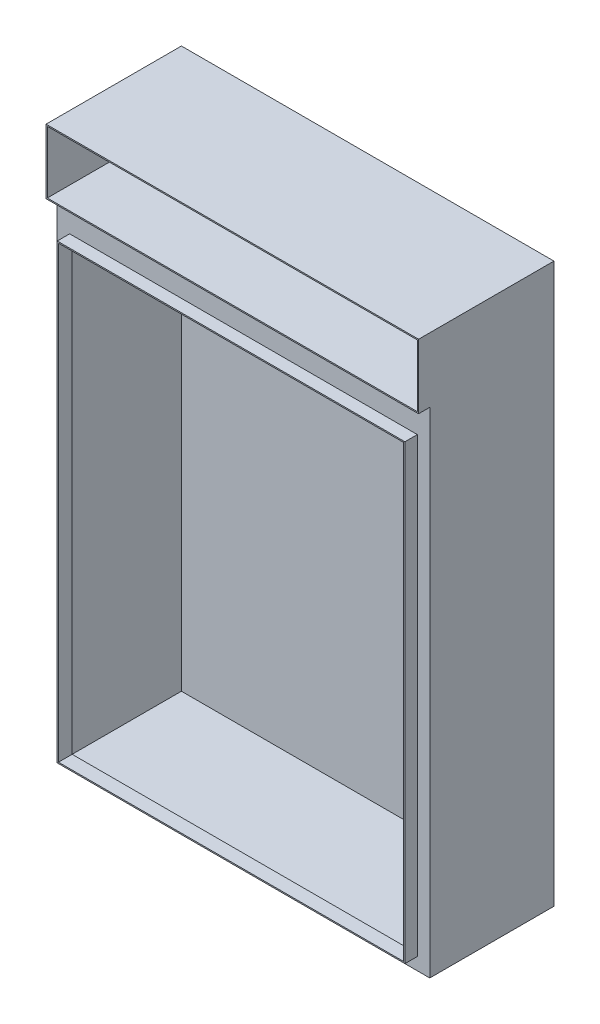
ISO-10303-21;
HEADER;
FILE_DESCRIPTION(('STEP AP214'),'2;1');
FILE_NAME('part.step','',(''),(''),'','','');
FILE_SCHEMA(('AUTOMOTIVE_DESIGN { 1 0 10303 214 1 1 1 1 }'));
ENDSEC;
DATA;
#1=APPLICATION_CONTEXT('core data for automotive mechanical design processes');
#2=APPLICATION_PROTOCOL_DEFINITION('international standard','automotive_design',2000,#1);
#3=PRODUCT_CONTEXT('',#1,'mechanical');
#4=PRODUCT('Part','Part','',(#3));
#5=PRODUCT_RELATED_PRODUCT_CATEGORY('part','',(#4));
#6=PRODUCT_DEFINITION_FORMATION('','',#4);
#7=PRODUCT_DEFINITION_CONTEXT('part definition',#1,'design');
#8=PRODUCT_DEFINITION('design','',#6,#7);
#9=PRODUCT_DEFINITION_SHAPE('','',#8);
#10=(LENGTH_UNIT() NAMED_UNIT(*) SI_UNIT(.MILLI.,.METRE.));
#11=(NAMED_UNIT(*) PLANE_ANGLE_UNIT() SI_UNIT($,.RADIAN.));
#12=(NAMED_UNIT(*) SI_UNIT($,.STERADIAN.) SOLID_ANGLE_UNIT());
#13=UNCERTAINTY_MEASURE_WITH_UNIT(LENGTH_MEASURE(1.E-05),#10,'distance_accuracy_value','');
#14=(GEOMETRIC_REPRESENTATION_CONTEXT(3) GLOBAL_UNCERTAINTY_ASSIGNED_CONTEXT((#13)) GLOBAL_UNIT_ASSIGNED_CONTEXT((#10,
#11,#12)) REPRESENTATION_CONTEXT('',''));
#15=CARTESIAN_POINT('',(0.,0.,0.));
#16=DIRECTION('',(0.,0.,1.));
#17=DIRECTION('',(1.,0.,0.));
#18=AXIS2_PLACEMENT_3D('',#15,#16,#17);
#19=CARTESIAN_POINT('',(0.,0.,200.));
#20=DIRECTION('',(0.,0.,1.));
#21=DIRECTION('',(1.,0.,0.));
#22=AXIS2_PLACEMENT_3D('',#19,#20,#21);
#23=PLANE('',#22);
#24=DIRECTION('',(1.,0.,0.));
#25=VECTOR('',#24,1.);
#26=CARTESIAN_POINT('',(-280.,-430.,200.));
#27=LINE('',#26,#25);
#28=CARTESIAN_POINT('',(-280.,-430.,200.));
#29=VERTEX_POINT('',#28);
#30=CARTESIAN_POINT('',(280.,-430.,200.));
#31=VERTEX_POINT('',#30);
#32=EDGE_CURVE('E282',#29,#31,#27,.T.);
#33=ORIENTED_EDGE('',*,*,#32,.F.);
#34=DIRECTION('',(0.,-1.,0.));
#35=VECTOR('',#34,1.);
#36=CARTESIAN_POINT('',(-280.,298.,200.));
#37=LINE('',#36,#35);
#38=CARTESIAN_POINT('',(-280.,298.,200.));
#39=VERTEX_POINT('',#38);
#40=EDGE_CURVE('E263',#39,#29,#37,.T.);
#41=ORIENTED_EDGE('',*,*,#40,.F.);
#42=DIRECTION('',(-1.,0.,0.));
#43=VECTOR('',#42,1.);
#44=CARTESIAN_POINT('',(-280.,298.,200.));
#45=LINE('',#44,#43);
#46=CARTESIAN_POINT('',(280.,298.,200.));
#47=VERTEX_POINT('',#46);
#48=EDGE_CURVE('E269',#47,#39,#45,.T.);
#49=ORIENTED_EDGE('',*,*,#48,.F.);
#50=DIRECTION('',(0.,1.,0.));
#51=VECTOR('',#50,1.);
#52=CARTESIAN_POINT('',(280.,298.,200.));
#53=LINE('',#52,#51);
#54=EDGE_CURVE('E285',#31,#47,#53,.T.);
#55=ORIENTED_EDGE('',*,*,#54,.F.);
#56=EDGE_LOOP('',(#33,#41,#49,#55));
#57=FACE_BOUND('',#56,.T.);
#58=DIRECTION('',(0.,1.,0.));
#59=VECTOR('',#58,1.);
#60=CARTESIAN_POINT('',(300.,-450.,200.));
#61=LINE('',#60,#59);
#62=CARTESIAN_POINT('',(300.,-450.,200.));
#63=VERTEX_POINT('',#62);
#64=CARTESIAN_POINT('',(300.,346.,200.));
#65=VERTEX_POINT('',#64);
#66=EDGE_CURVE('E55',#63,#65,#61,.T.);
#67=ORIENTED_EDGE('',*,*,#66,.T.);
#68=DIRECTION('',(1.,0.,0.));
#69=VECTOR('',#68,1.);
#70=CARTESIAN_POINT('',(-300.,346.,200.));
#71=LINE('',#70,#69);
#72=CARTESIAN_POINT('',(-300.,346.,200.));
#73=VERTEX_POINT('',#72);
#74=EDGE_CURVE('E59',#73,#65,#71,.T.);
#75=ORIENTED_EDGE('',*,*,#74,.F.);
#76=DIRECTION('',(0.,-1.,0.));
#77=VECTOR('',#76,1.);
#78=CARTESIAN_POINT('',(-300.,-450.,200.));
#79=LINE('',#78,#77);
#80=CARTESIAN_POINT('',(-300.,-450.,200.));
#81=VERTEX_POINT('',#80);
#82=EDGE_CURVE('E388',#73,#81,#79,.T.);
#83=ORIENTED_EDGE('',*,*,#82,.T.);
#84=DIRECTION('',(1.,0.,0.));
#85=VECTOR('',#84,1.);
#86=CARTESIAN_POINT('',(300.,-450.,200.));
#87=LINE('',#86,#85);
#88=EDGE_CURVE('E391',#81,#63,#87,.T.);
#89=ORIENTED_EDGE('',*,*,#88,.T.);
#90=EDGE_LOOP('',(#67,#75,#83,#89));
#91=FACE_BOUND('',#90,.T.);
#92=ADVANCED_FACE('F39',(#57,#91),#23,.T.);
#93=CARTESIAN_POINT('',(0.,0.,198.));
#94=DIRECTION('',(0.,0.,1.));
#95=DIRECTION('',(1.,0.,0.));
#96=AXIS2_PLACEMENT_3D('',#93,#94,#95);
#97=PLANE('',#96);
#98=DIRECTION('',(-1.,0.,0.));
#99=VECTOR('',#98,1.);
#100=CARTESIAN_POINT('',(-278.,296.,198.));
#101=LINE('',#100,#99);
#102=CARTESIAN_POINT('',(278.,296.,198.));
#103=VERTEX_POINT('',#102);
#104=CARTESIAN_POINT('',(-278.,296.,198.));
#105=VERTEX_POINT('',#104);
#106=EDGE_CURVE('E316',#103,#105,#101,.T.);
#107=ORIENTED_EDGE('',*,*,#106,.T.);
#108=DIRECTION('',(0.,-1.,0.));
#109=VECTOR('',#108,1.);
#110=CARTESIAN_POINT('',(-278.,296.,198.));
#111=LINE('',#110,#109);
#112=CARTESIAN_POINT('',(-278.,-428.,198.));
#113=VERTEX_POINT('',#112);
#114=EDGE_CURVE('E304',#105,#113,#111,.T.);
#115=ORIENTED_EDGE('',*,*,#114,.T.);
#116=DIRECTION('',(1.,0.,0.));
#117=VECTOR('',#116,1.);
#118=CARTESIAN_POINT('',(-278.,-428.,198.));
#119=LINE('',#118,#117);
#120=CARTESIAN_POINT('',(278.,-428.,198.));
#121=VERTEX_POINT('',#120);
#122=EDGE_CURVE('E308',#113,#121,#119,.T.);
#123=ORIENTED_EDGE('',*,*,#122,.T.);
#124=DIRECTION('',(0.,1.,0.));
#125=VECTOR('',#124,1.);
#126=CARTESIAN_POINT('',(278.,296.,198.));
#127=LINE('',#126,#125);
#128=EDGE_CURVE('E312',#121,#103,#127,.T.);
#129=ORIENTED_EDGE('',*,*,#128,.T.);
#130=EDGE_LOOP('',(#107,#115,#123,#129));
#131=FACE_BOUND('',#130,.T.);
#132=DIRECTION('',(0.,-1.,0.));
#133=VECTOR('',#132,1.);
#134=CARTESIAN_POINT('',(-298.,346.,198.));
#135=LINE('',#134,#133);
#136=CARTESIAN_POINT('',(-298.,346.,198.));
#137=VERTEX_POINT('',#136);
#138=CARTESIAN_POINT('',(-298.,-448.,198.));
#139=VERTEX_POINT('',#138);
#140=EDGE_CURVE('E324',#137,#139,#135,.T.);
#141=ORIENTED_EDGE('',*,*,#140,.F.);
#142=DIRECTION('',(-1.,0.,0.));
#143=VECTOR('',#142,1.);
#144=CARTESIAN_POINT('',(-298.,346.,198.));
#145=LINE('',#144,#143);
#146=CARTESIAN_POINT('',(298.,346.,198.));
#147=VERTEX_POINT('',#146);
#148=EDGE_CURVE('E342',#147,#137,#145,.T.);
#149=ORIENTED_EDGE('',*,*,#148,.F.);
#150=DIRECTION('',(0.,1.,0.));
#151=VECTOR('',#150,1.);
#152=CARTESIAN_POINT('',(298.,346.,198.));
#153=LINE('',#152,#151);
#154=CARTESIAN_POINT('',(298.,-448.,198.));
#155=VERTEX_POINT('',#154);
#156=EDGE_CURVE('E338',#155,#147,#153,.T.);
#157=ORIENTED_EDGE('',*,*,#156,.F.);
#158=DIRECTION('',(1.,0.,0.));
#159=VECTOR('',#158,1.);
#160=CARTESIAN_POINT('',(-298.,-448.,198.));
#161=LINE('',#160,#159);
#162=EDGE_CURVE('E335',#139,#155,#161,.T.);
#163=ORIENTED_EDGE('',*,*,#162,.F.);
#164=EDGE_LOOP('',(#141,#149,#157,#163));
#165=FACE_BOUND('',#164,.T.);
#166=ADVANCED_FACE('F453',(#131,#165),#97,.F.);
#167=CARTESIAN_POINT('',(-278.,296.,198.));
#168=DIRECTION('',(-1.,0.,0.));
#169=DIRECTION('',(0.,-1.,0.));
#170=AXIS2_PLACEMENT_3D('',#167,#168,#169);
#171=PLANE('',#170);
#172=DIRECTION('',(0.,0.,1.));
#173=VECTOR('',#172,1.);
#174=CARTESIAN_POINT('',(-278.,296.,198.));
#175=LINE('',#174,#173);
#176=CARTESIAN_POINT('',(-278.,296.,220.));
#177=VERTEX_POINT('',#176);
#178=EDGE_CURVE('E321',#105,#177,#175,.T.);
#179=ORIENTED_EDGE('',*,*,#178,.T.);
#180=DIRECTION('',(0.,-1.,0.));
#181=VECTOR('',#180,1.);
#182=CARTESIAN_POINT('',(-278.,296.,220.));
#183=LINE('',#182,#181);
#184=CARTESIAN_POINT('',(-278.,-428.,220.));
#185=VERTEX_POINT('',#184);
#186=EDGE_CURVE('E247',#177,#185,#183,.T.);
#187=ORIENTED_EDGE('',*,*,#186,.T.);
#188=DIRECTION('',(0.,0.,1.));
#189=VECTOR('',#188,1.);
#190=CARTESIAN_POINT('',(-278.,-428.,198.));
#191=LINE('',#190,#189);
#192=EDGE_CURVE('E320',#113,#185,#191,.T.);
#193=ORIENTED_EDGE('',*,*,#192,.F.);
#194=ORIENTED_EDGE('',*,*,#114,.F.);
#195=EDGE_LOOP('',(#179,#187,#193,#194));
#196=FACE_BOUND('',#195,.T.);
#197=ADVANCED_FACE('F459',(#196),#171,.F.);
#198=CARTESIAN_POINT('',(-278.,296.,198.));
#199=DIRECTION('',(0.,1.,0.));
#200=DIRECTION('',(0.,0.,1.));
#201=AXIS2_PLACEMENT_3D('',#198,#199,#200);
#202=PLANE('',#201);
#203=DIRECTION('',(0.,0.,1.));
#204=VECTOR('',#203,1.);
#205=CARTESIAN_POINT('',(278.,296.,198.));
#206=LINE('',#205,#204);
#207=CARTESIAN_POINT('',(278.,296.,220.));
#208=VERTEX_POINT('',#207);
#209=EDGE_CURVE('E325',#103,#208,#206,.T.);
#210=ORIENTED_EDGE('',*,*,#209,.T.);
#211=DIRECTION('',(-1.,0.,0.));
#212=VECTOR('',#211,1.);
#213=CARTESIAN_POINT('',(-278.,296.,220.));
#214=LINE('',#213,#212);
#215=EDGE_CURVE('E259',#208,#177,#214,.T.);
#216=ORIENTED_EDGE('',*,*,#215,.T.);
#217=ORIENTED_EDGE('',*,*,#178,.F.);
#218=ORIENTED_EDGE('',*,*,#106,.F.);
#219=EDGE_LOOP('',(#210,#216,#217,#218));
#220=FACE_BOUND('',#219,.T.);
#221=ADVANCED_FACE('F584',(#220),#202,.F.);
#222=CARTESIAN_POINT('',(278.,296.,198.));
#223=DIRECTION('',(1.,0.,0.));
#224=DIRECTION('',(0.,1.,0.));
#225=AXIS2_PLACEMENT_3D('',#222,#223,#224);
#226=PLANE('',#225);
#227=DIRECTION('',(0.,0.,1.));
#228=VECTOR('',#227,1.);
#229=CARTESIAN_POINT('',(278.,-428.,198.));
#230=LINE('',#229,#228);
#231=CARTESIAN_POINT('',(278.,-428.,220.));
#232=VERTEX_POINT('',#231);
#233=EDGE_CURVE('E328',#121,#232,#230,.T.);
#234=ORIENTED_EDGE('',*,*,#233,.T.);
#235=DIRECTION('',(0.,1.,0.));
#236=VECTOR('',#235,1.);
#237=CARTESIAN_POINT('',(278.,296.,220.));
#238=LINE('',#237,#236);
#239=EDGE_CURVE('E255',#232,#208,#238,.T.);
#240=ORIENTED_EDGE('',*,*,#239,.T.);
#241=ORIENTED_EDGE('',*,*,#209,.F.);
#242=ORIENTED_EDGE('',*,*,#128,.F.);
#243=EDGE_LOOP('',(#234,#240,#241,#242));
#244=FACE_BOUND('',#243,.T.);
#245=ADVANCED_FACE('F595',(#244),#226,.F.);
#246=CARTESIAN_POINT('',(-278.,-428.,198.));
#247=DIRECTION('',(0.,-1.,0.));
#248=DIRECTION('',(0.,0.,-1.));
#249=AXIS2_PLACEMENT_3D('',#246,#247,#248);
#250=PLANE('',#249);
#251=ORIENTED_EDGE('',*,*,#192,.T.);
#252=DIRECTION('',(1.,0.,0.));
#253=VECTOR('',#252,1.);
#254=CARTESIAN_POINT('',(-278.,-428.,220.));
#255=LINE('',#254,#253);
#256=EDGE_CURVE('E251',#185,#232,#255,.T.);
#257=ORIENTED_EDGE('',*,*,#256,.T.);
#258=ORIENTED_EDGE('',*,*,#233,.F.);
#259=ORIENTED_EDGE('',*,*,#122,.F.);
#260=EDGE_LOOP('',(#251,#257,#258,#259));
#261=FACE_BOUND('',#260,.T.);
#262=ADVANCED_FACE('F605',(#261),#250,.F.);
#263=CARTESIAN_POINT('',(0.,0.,2.));
#264=DIRECTION('',(0.,0.,1.));
#265=DIRECTION('',(1.,0.,0.));
#266=AXIS2_PLACEMENT_3D('',#263,#264,#265);
#267=PLANE('',#266);
#268=DIRECTION('',(0.,1.,0.));
#269=VECTOR('',#268,1.);
#270=CARTESIAN_POINT('',(298.,-450.,2.));
#271=LINE('',#270,#269);
#272=CARTESIAN_POINT('',(298.,-448.,2.));
#273=VERTEX_POINT('',#272);
#274=CARTESIAN_POINT('',(298.,346.,2.));
#275=VERTEX_POINT('',#274);
#276=EDGE_CURVE('E379',#273,#275,#271,.T.);
#277=ORIENTED_EDGE('',*,*,#276,.T.);
#278=DIRECTION('',(1.,0.,0.));
#279=VECTOR('',#278,1.);
#280=CARTESIAN_POINT('',(298.,346.,2.));
#281=LINE('',#280,#279);
#282=CARTESIAN_POINT('',(-298.,346.,2.));
#283=VERTEX_POINT('',#282);
#284=EDGE_CURVE('E345',#283,#275,#281,.T.);
#285=ORIENTED_EDGE('',*,*,#284,.F.);
#286=DIRECTION('',(0.,-1.,0.));
#287=VECTOR('',#286,1.);
#288=CARTESIAN_POINT('',(-298.,-450.,2.));
#289=LINE('',#288,#287);
#290=CARTESIAN_POINT('',(-298.,-448.,2.));
#291=VERTEX_POINT('',#290);
#292=EDGE_CURVE('E359',#283,#291,#289,.T.);
#293=ORIENTED_EDGE('',*,*,#292,.T.);
#294=DIRECTION('',(1.,0.,0.));
#295=VECTOR('',#294,1.);
#296=CARTESIAN_POINT('',(300.,-448.,2.));
#297=LINE('',#296,#295);
#298=EDGE_CURVE('E363',#291,#273,#297,.T.);
#299=ORIENTED_EDGE('',*,*,#298,.T.);
#300=EDGE_LOOP('',(#277,#285,#293,#299));
#301=FACE_BOUND('',#300,.T.);
#302=ADVANCED_FACE('F449',(#301),#267,.T.);
#303=CARTESIAN_POINT('',(298.,346.,200.));
#304=DIRECTION('',(0.,1.,0.));
#305=DIRECTION('',(0.,0.,1.));
#306=AXIS2_PLACEMENT_3D('',#303,#304,#305);
#307=PLANE('',#306);
#308=ORIENTED_EDGE('',*,*,#148,.T.);
#309=DIRECTION('',(0.,0.,-1.));
#310=VECTOR('',#309,1.);
#311=CARTESIAN_POINT('',(-298.,346.,200.));
#312=LINE('',#311,#310);
#313=EDGE_CURVE('E356',#137,#283,#312,.T.);
#314=ORIENTED_EDGE('',*,*,#313,.T.);
#315=ORIENTED_EDGE('',*,*,#284,.T.);
#316=DIRECTION('',(0.,0.,-1.));
#317=VECTOR('',#316,1.);
#318=CARTESIAN_POINT('',(298.,346.,200.));
#319=LINE('',#318,#317);
#320=EDGE_CURVE('E353',#147,#275,#319,.T.);
#321=ORIENTED_EDGE('',*,*,#320,.F.);
#322=EDGE_LOOP('',(#308,#314,#315,#321));
#323=FACE_BOUND('',#322,.T.);
#324=ADVANCED_FACE('F539',(#323),#307,.F.);
#325=CARTESIAN_POINT('',(300.,-448.,200.));
#326=DIRECTION('',(0.,1.,0.));
#327=DIRECTION('',(-1.,0.,0.));
#328=AXIS2_PLACEMENT_3D('',#325,#326,#327);
#329=PLANE('',#328);
#330=DIRECTION('',(0.,0.,-1.));
#331=VECTOR('',#330,1.);
#332=CARTESIAN_POINT('',(-298.,-448.,200.));
#333=LINE('',#332,#331);
#334=EDGE_CURVE('E364',#139,#291,#333,.T.);
#335=ORIENTED_EDGE('',*,*,#334,.F.);
#336=ORIENTED_EDGE('',*,*,#162,.T.);
#337=DIRECTION('',(0.,0.,-1.));
#338=VECTOR('',#337,1.);
#339=CARTESIAN_POINT('',(298.,-448.,200.));
#340=LINE('',#339,#338);
#341=EDGE_CURVE('E368',#155,#273,#340,.T.);
#342=ORIENTED_EDGE('',*,*,#341,.T.);
#343=ORIENTED_EDGE('',*,*,#298,.F.);
#344=EDGE_LOOP('',(#335,#336,#342,#343));
#345=FACE_BOUND('',#344,.T.);
#346=ADVANCED_FACE('F545',(#345),#329,.T.);
#347=CARTESIAN_POINT('',(298.,-450.,200.));
#348=DIRECTION('',(-1.,0.,0.));
#349=DIRECTION('',(0.,0.,1.));
#350=AXIS2_PLACEMENT_3D('',#347,#348,#349);
#351=PLANE('',#350);
#352=ORIENTED_EDGE('',*,*,#341,.F.);
#353=ORIENTED_EDGE('',*,*,#156,.T.);
#354=ORIENTED_EDGE('',*,*,#320,.T.);
#355=ORIENTED_EDGE('',*,*,#276,.F.);
#356=EDGE_LOOP('',(#352,#353,#354,#355));
#357=FACE_BOUND('',#356,.T.);
#358=ADVANCED_FACE('F508',(#357),#351,.T.);
#359=CARTESIAN_POINT('',(-298.,-450.,200.));
#360=DIRECTION('',(1.,0.,0.));
#361=DIRECTION('',(0.,0.,-1.));
#362=AXIS2_PLACEMENT_3D('',#359,#360,#361);
#363=PLANE('',#362);
#364=ORIENTED_EDGE('',*,*,#313,.F.);
#365=ORIENTED_EDGE('',*,*,#140,.T.);
#366=ORIENTED_EDGE('',*,*,#334,.T.);
#367=ORIENTED_EDGE('',*,*,#292,.F.);
#368=EDGE_LOOP('',(#364,#365,#366,#367));
#369=FACE_BOUND('',#368,.T.);
#370=ADVANCED_FACE('F526',(#369),#363,.T.);
#371=CARTESIAN_POINT('',(0.,0.,220.));
#372=DIRECTION('',(0.,0.,1.));
#373=DIRECTION('',(1.,0.,0.));
#374=AXIS2_PLACEMENT_3D('',#371,#372,#373);
#375=PLANE('',#374);
#376=DIRECTION('',(0.,-1.,0.));
#377=VECTOR('',#376,1.);
#378=CARTESIAN_POINT('',(-280.,298.,220.));
#379=LINE('',#378,#377);
#380=CARTESIAN_POINT('',(-280.,298.,220.));
#381=VERTEX_POINT('',#380);
#382=CARTESIAN_POINT('',(-280.,-430.,220.));
#383=VERTEX_POINT('',#382);
#384=EDGE_CURVE('E264',#381,#383,#379,.T.);
#385=ORIENTED_EDGE('',*,*,#384,.T.);
#386=DIRECTION('',(1.,0.,0.));
#387=VECTOR('',#386,1.);
#388=CARTESIAN_POINT('',(-280.,-430.,220.));
#389=LINE('',#388,#387);
#390=CARTESIAN_POINT('',(280.,-430.,220.));
#391=VERTEX_POINT('',#390);
#392=EDGE_CURVE('E268',#383,#391,#389,.T.);
#393=ORIENTED_EDGE('',*,*,#392,.T.);
#394=DIRECTION('',(0.,1.,0.));
#395=VECTOR('',#394,1.);
#396=CARTESIAN_POINT('',(280.,298.,220.));
#397=LINE('',#396,#395);
#398=CARTESIAN_POINT('',(280.,298.,220.));
#399=VERTEX_POINT('',#398);
#400=EDGE_CURVE('E272',#391,#399,#397,.T.);
#401=ORIENTED_EDGE('',*,*,#400,.T.);
#402=DIRECTION('',(-1.,0.,0.));
#403=VECTOR('',#402,1.);
#404=CARTESIAN_POINT('',(-280.,298.,220.));
#405=LINE('',#404,#403);
#406=EDGE_CURVE('E275',#399,#381,#405,.T.);
#407=ORIENTED_EDGE('',*,*,#406,.T.);
#408=EDGE_LOOP('',(#385,#393,#401,#407));
#409=FACE_BOUND('',#408,.T.);
#410=ORIENTED_EDGE('',*,*,#256,.F.);
#411=ORIENTED_EDGE('',*,*,#186,.F.);
#412=ORIENTED_EDGE('',*,*,#215,.F.);
#413=ORIENTED_EDGE('',*,*,#239,.F.);
#414=EDGE_LOOP('',(#410,#411,#412,#413));
#415=FACE_BOUND('',#414,.T.);
#416=ADVANCED_FACE('F570',(#409,#415),#375,.T.);
#417=CARTESIAN_POINT('',(-280.,298.,220.));
#418=DIRECTION('',(1.,0.,0.));
#419=DIRECTION('',(0.,1.,0.));
#420=AXIS2_PLACEMENT_3D('',#417,#418,#419);
#421=PLANE('',#420);
#422=ORIENTED_EDGE('',*,*,#40,.T.);
#423=DIRECTION('',(0.,0.,-1.));
#424=VECTOR('',#423,1.);
#425=CARTESIAN_POINT('',(-280.,-430.,220.));
#426=LINE('',#425,#424);
#427=EDGE_CURVE('E301',#383,#29,#426,.T.);
#428=ORIENTED_EDGE('',*,*,#427,.F.);
#429=ORIENTED_EDGE('',*,*,#384,.F.);
#430=DIRECTION('',(0.,0.,-1.));
#431=VECTOR('',#430,1.);
#432=CARTESIAN_POINT('',(-280.,298.,220.));
#433=LINE('',#432,#431);
#434=EDGE_CURVE('E278',#381,#39,#433,.T.);
#435=ORIENTED_EDGE('',*,*,#434,.T.);
#436=EDGE_LOOP('',(#422,#428,#429,#435));
#437=FACE_BOUND('',#436,.T.);
#438=ADVANCED_FACE('F627',(#437),#421,.F.);
#439=CARTESIAN_POINT('',(-280.,-430.,220.));
#440=DIRECTION('',(0.,1.,0.));
#441=DIRECTION('',(0.,0.,1.));
#442=AXIS2_PLACEMENT_3D('',#439,#440,#441);
#443=PLANE('',#442);
#444=ORIENTED_EDGE('',*,*,#32,.T.);
#445=DIRECTION('',(0.,0.,-1.));
#446=VECTOR('',#445,1.);
#447=CARTESIAN_POINT('',(280.,-430.,220.));
#448=LINE('',#447,#446);
#449=EDGE_CURVE('E297',#391,#31,#448,.T.);
#450=ORIENTED_EDGE('',*,*,#449,.F.);
#451=ORIENTED_EDGE('',*,*,#392,.F.);
#452=ORIENTED_EDGE('',*,*,#427,.T.);
#453=EDGE_LOOP('',(#444,#450,#451,#452));
#454=FACE_BOUND('',#453,.T.);
#455=ADVANCED_FACE('F635',(#454),#443,.F.);
#456=CARTESIAN_POINT('',(280.,298.,220.));
#457=DIRECTION('',(-1.,0.,0.));
#458=DIRECTION('',(0.,-1.,0.));
#459=AXIS2_PLACEMENT_3D('',#456,#457,#458);
#460=PLANE('',#459);
#461=ORIENTED_EDGE('',*,*,#54,.T.);
#462=DIRECTION('',(0.,0.,-1.));
#463=VECTOR('',#462,1.);
#464=CARTESIAN_POINT('',(280.,298.,220.));
#465=LINE('',#464,#463);
#466=EDGE_CURVE('E294',#399,#47,#465,.T.);
#467=ORIENTED_EDGE('',*,*,#466,.F.);
#468=ORIENTED_EDGE('',*,*,#400,.F.);
#469=ORIENTED_EDGE('',*,*,#449,.T.);
#470=EDGE_LOOP('',(#461,#467,#468,#469));
#471=FACE_BOUND('',#470,.T.);
#472=ADVANCED_FACE('F644',(#471),#460,.F.);
#473=CARTESIAN_POINT('',(-280.,298.,220.));
#474=DIRECTION('',(0.,-1.,0.));
#475=DIRECTION('',(0.,0.,-1.));
#476=AXIS2_PLACEMENT_3D('',#473,#474,#475);
#477=PLANE('',#476);
#478=ORIENTED_EDGE('',*,*,#48,.T.);
#479=ORIENTED_EDGE('',*,*,#434,.F.);
#480=ORIENTED_EDGE('',*,*,#406,.F.);
#481=ORIENTED_EDGE('',*,*,#466,.T.);
#482=EDGE_LOOP('',(#478,#479,#480,#481));
#483=FACE_BOUND('',#482,.T.);
#484=ADVANCED_FACE('F467',(#483),#477,.F.);
#485=CARTESIAN_POINT('',(0.,0.,0.));
#486=DIRECTION('',(0.,0.,1.));
#487=DIRECTION('',(1.,0.,0.));
#488=AXIS2_PLACEMENT_3D('',#485,#486,#487);
#489=PLANE('',#488);
#490=DIRECTION('',(0.,-1.,0.));
#491=VECTOR('',#490,1.);
#492=CARTESIAN_POINT('',(-300.,-450.,0.));
#493=LINE('',#492,#491);
#494=CARTESIAN_POINT('',(-300.,450.,0.));
#495=VERTEX_POINT('',#494);
#496=CARTESIAN_POINT('',(-300.,-450.,0.));
#497=VERTEX_POINT('',#496);
#498=EDGE_CURVE('E367',#495,#497,#493,.T.);
#499=ORIENTED_EDGE('',*,*,#498,.F.);
#500=DIRECTION('',(-1.,0.,0.));
#501=VECTOR('',#500,1.);
#502=CARTESIAN_POINT('',(300.,450.,0.));
#503=LINE('',#502,#501);
#504=CARTESIAN_POINT('',(300.,450.,0.));
#505=VERTEX_POINT('',#504);
#506=EDGE_CURVE('E392',#505,#495,#503,.T.);
#507=ORIENTED_EDGE('',*,*,#506,.F.);
#508=DIRECTION('',(0.,1.,0.));
#509=VECTOR('',#508,1.);
#510=CARTESIAN_POINT('',(300.,-450.,0.));
#511=LINE('',#510,#509);
#512=CARTESIAN_POINT('',(300.,-450.,0.));
#513=VERTEX_POINT('',#512);
#514=EDGE_CURVE('E404',#513,#505,#511,.T.);
#515=ORIENTED_EDGE('',*,*,#514,.F.);
#516=DIRECTION('',(1.,0.,0.));
#517=VECTOR('',#516,1.);
#518=CARTESIAN_POINT('',(300.,-450.,0.));
#519=LINE('',#518,#517);
#520=EDGE_CURVE('E401',#497,#513,#519,.T.);
#521=ORIENTED_EDGE('',*,*,#520,.F.);
#522=EDGE_LOOP('',(#499,#507,#515,#521));
#523=FACE_BOUND('',#522,.T.);
#524=ADVANCED_FACE('F426',(#523),#489,.F.);
#525=CARTESIAN_POINT('',(300.,450.,200.));
#526=DIRECTION('',(0.,-1.,0.));
#527=DIRECTION('',(1.,0.,0.));
#528=AXIS2_PLACEMENT_3D('',#525,#526,#527);
#529=PLANE('',#528);
#530=ORIENTED_EDGE('',*,*,#506,.T.);
#531=DIRECTION('',(0.,0.,-1.));
#532=VECTOR('',#531,1.);
#533=CARTESIAN_POINT('',(-300.,450.,200.));
#534=LINE('',#533,#532);
#535=CARTESIAN_POINT('',(-300.,450.,218.));
#536=VERTEX_POINT('',#535);
#537=EDGE_CURVE('E397',#536,#495,#534,.T.);
#538=ORIENTED_EDGE('',*,*,#537,.F.);
#539=DIRECTION('',(-1.,0.,0.));
#540=VECTOR('',#539,1.);
#541=CARTESIAN_POINT('',(-300.,450.,218.));
#542=LINE('',#541,#540);
#543=CARTESIAN_POINT('',(300.,450.,218.));
#544=VERTEX_POINT('',#543);
#545=EDGE_CURVE('E233',#544,#536,#542,.T.);
#546=ORIENTED_EDGE('',*,*,#545,.F.);
#547=DIRECTION('',(0.,0.,-1.));
#548=VECTOR('',#547,1.);
#549=CARTESIAN_POINT('',(300.,450.,200.));
#550=LINE('',#549,#548);
#551=EDGE_CURVE('E412',#544,#505,#550,.T.);
#552=ORIENTED_EDGE('',*,*,#551,.T.);
#553=EDGE_LOOP('',(#530,#538,#546,#552));
#554=FACE_BOUND('',#553,.T.);
#555=ADVANCED_FACE('F428',(#554),#529,.F.);
#556=CARTESIAN_POINT('',(300.,-450.,200.));
#557=DIRECTION('',(-1.,0.,0.));
#558=DIRECTION('',(0.,0.,1.));
#559=AXIS2_PLACEMENT_3D('',#556,#557,#558);
#560=PLANE('',#559);
#561=ORIENTED_EDGE('',*,*,#514,.T.);
#562=ORIENTED_EDGE('',*,*,#551,.F.);
#563=DIRECTION('',(0.,1.,0.));
#564=VECTOR('',#563,1.);
#565=CARTESIAN_POINT('',(300.,450.,218.));
#566=LINE('',#565,#564);
#567=CARTESIAN_POINT('',(300.,346.,218.));
#568=VERTEX_POINT('',#567);
#569=EDGE_CURVE('E229',#568,#544,#566,.T.);
#570=ORIENTED_EDGE('',*,*,#569,.F.);
#571=DIRECTION('',(0.,0.,-1.));
#572=VECTOR('',#571,1.);
#573=CARTESIAN_POINT('',(300.,346.,218.));
#574=LINE('',#573,#572);
#575=EDGE_CURVE('E237',#568,#65,#574,.T.);
#576=ORIENTED_EDGE('',*,*,#575,.T.);
#577=ORIENTED_EDGE('',*,*,#66,.F.);
#578=DIRECTION('',(0.,0.,-1.));
#579=VECTOR('',#578,1.);
#580=CARTESIAN_POINT('',(300.,-450.,200.));
#581=LINE('',#580,#579);
#582=EDGE_CURVE('E48',#63,#513,#581,.T.);
#583=ORIENTED_EDGE('',*,*,#582,.T.);
#584=EDGE_LOOP('',(#561,#562,#570,#576,#577,#583));
#585=FACE_BOUND('',#584,.T.);
#586=ADVANCED_FACE('F420',(#585),#560,.F.);
#587=CARTESIAN_POINT('',(300.,-450.,200.));
#588=DIRECTION('',(0.,1.,0.));
#589=DIRECTION('',(-1.,0.,0.));
#590=AXIS2_PLACEMENT_3D('',#587,#588,#589);
#591=PLANE('',#590);
#592=ORIENTED_EDGE('',*,*,#520,.T.);
#593=ORIENTED_EDGE('',*,*,#582,.F.);
#594=ORIENTED_EDGE('',*,*,#88,.F.);
#595=DIRECTION('',(0.,0.,-1.));
#596=VECTOR('',#595,1.);
#597=CARTESIAN_POINT('',(-300.,-450.,200.));
#598=LINE('',#597,#596);
#599=EDGE_CURVE('E11',#81,#497,#598,.T.);
#600=ORIENTED_EDGE('',*,*,#599,.T.);
#601=EDGE_LOOP('',(#592,#593,#594,#600));
#602=FACE_BOUND('',#601,.T.);
#603=ADVANCED_FACE('F471',(#602),#591,.F.);
#604=CARTESIAN_POINT('',(-300.,-450.,200.));
#605=DIRECTION('',(1.,0.,0.));
#606=DIRECTION('',(0.,0.,-1.));
#607=AXIS2_PLACEMENT_3D('',#604,#605,#606);
#608=PLANE('',#607);
#609=ORIENTED_EDGE('',*,*,#498,.T.);
#610=ORIENTED_EDGE('',*,*,#599,.F.);
#611=ORIENTED_EDGE('',*,*,#82,.F.);
#612=DIRECTION('',(0.,0.,-1.));
#613=VECTOR('',#612,1.);
#614=CARTESIAN_POINT('',(-300.,346.,218.));
#615=LINE('',#614,#613);
#616=CARTESIAN_POINT('',(-300.,346.,218.));
#617=VERTEX_POINT('',#616);
#618=EDGE_CURVE('E243',#617,#73,#615,.T.);
#619=ORIENTED_EDGE('',*,*,#618,.F.);
#620=DIRECTION('',(0.,-1.,0.));
#621=VECTOR('',#620,1.);
#622=CARTESIAN_POINT('',(-300.,450.,218.));
#623=LINE('',#622,#621);
#624=EDGE_CURVE('E222',#536,#617,#623,.T.);
#625=ORIENTED_EDGE('',*,*,#624,.F.);
#626=ORIENTED_EDGE('',*,*,#537,.T.);
#627=EDGE_LOOP('',(#609,#610,#611,#619,#625,#626));
#628=FACE_BOUND('',#627,.T.);
#629=ADVANCED_FACE('F41',(#628),#608,.F.);
#630=CARTESIAN_POINT('',(0.,0.,218.));
#631=DIRECTION('',(0.,0.,1.));
#632=DIRECTION('',(1.,0.,0.));
#633=AXIS2_PLACEMENT_3D('',#630,#631,#632);
#634=PLANE('',#633);
#635=ORIENTED_EDGE('',*,*,#624,.T.);
#636=DIRECTION('',(1.,0.,0.));
#637=VECTOR('',#636,1.);
#638=CARTESIAN_POINT('',(-300.,346.,218.));
#639=LINE('',#638,#637);
#640=EDGE_CURVE('E226',#617,#568,#639,.T.);
#641=ORIENTED_EDGE('',*,*,#640,.T.);
#642=ORIENTED_EDGE('',*,*,#569,.T.);
#643=ORIENTED_EDGE('',*,*,#545,.T.);
#644=EDGE_LOOP('',(#635,#641,#642,#643));
#645=FACE_BOUND('',#644,.T.);
#646=DIRECTION('',(1.,0.,0.));
#647=VECTOR('',#646,1.);
#648=CARTESIAN_POINT('',(-298.,348.,218.));
#649=LINE('',#648,#647);
#650=CARTESIAN_POINT('',(-298.,348.,218.));
#651=VERTEX_POINT('',#650);
#652=CARTESIAN_POINT('',(298.,348.,218.));
#653=VERTEX_POINT('',#652);
#654=EDGE_CURVE('E191',#651,#653,#649,.T.);
#655=ORIENTED_EDGE('',*,*,#654,.F.);
#656=DIRECTION('',(0.,-1.,0.));
#657=VECTOR('',#656,1.);
#658=CARTESIAN_POINT('',(-298.,448.,218.));
#659=LINE('',#658,#657);
#660=CARTESIAN_POINT('',(-298.,448.,218.));
#661=VERTEX_POINT('',#660);
#662=EDGE_CURVE('E202',#661,#651,#659,.T.);
#663=ORIENTED_EDGE('',*,*,#662,.F.);
#664=DIRECTION('',(-1.,0.,0.));
#665=VECTOR('',#664,1.);
#666=CARTESIAN_POINT('',(-298.,448.,218.));
#667=LINE('',#666,#665);
#668=CARTESIAN_POINT('',(298.,448.,218.));
#669=VERTEX_POINT('',#668);
#670=EDGE_CURVE('E217',#669,#661,#667,.T.);
#671=ORIENTED_EDGE('',*,*,#670,.F.);
#672=DIRECTION('',(0.,1.,0.));
#673=VECTOR('',#672,1.);
#674=CARTESIAN_POINT('',(298.,448.,218.));
#675=LINE('',#674,#673);
#676=EDGE_CURVE('E213',#653,#669,#675,.T.);
#677=ORIENTED_EDGE('',*,*,#676,.F.);
#678=EDGE_LOOP('',(#655,#663,#671,#677));
#679=FACE_BOUND('',#678,.T.);
#680=ADVANCED_FACE('F211',(#645,#679),#634,.T.);
#681=CARTESIAN_POINT('',(-300.,346.,218.));
#682=DIRECTION('',(0.,1.,0.));
#683=DIRECTION('',(0.,0.,1.));
#684=AXIS2_PLACEMENT_3D('',#681,#682,#683);
#685=PLANE('',#684);
#686=ORIENTED_EDGE('',*,*,#74,.T.);
#687=ORIENTED_EDGE('',*,*,#575,.F.);
#688=ORIENTED_EDGE('',*,*,#640,.F.);
#689=ORIENTED_EDGE('',*,*,#618,.T.);
#690=EDGE_LOOP('',(#686,#687,#688,#689));
#691=FACE_BOUND('',#690,.T.);
#692=ADVANCED_FACE('F438',(#691),#685,.F.);
#693=CARTESIAN_POINT('',(-298.,448.,2.));
#694=VERTEX_POINT('',#693);
#695=CARTESIAN_POINT('',(-298.,348.,2.));
#696=VERTEX_POINT('',#695);
#697=EDGE_CURVE('E360',#694,#696,#289,.T.);
#698=ORIENTED_EDGE('',*,*,#697,.T.);
#699=DIRECTION('',(-1.,0.,0.));
#700=VECTOR('',#699,1.);
#701=CARTESIAN_POINT('',(298.,348.,2.));
#702=LINE('',#701,#700);
#703=CARTESIAN_POINT('',(298.,348.,2.));
#704=VERTEX_POINT('',#703);
#705=EDGE_CURVE('E194',#704,#696,#702,.T.);
#706=ORIENTED_EDGE('',*,*,#705,.F.);
#707=CARTESIAN_POINT('',(298.,448.,2.));
#708=VERTEX_POINT('',#707);
#709=EDGE_CURVE('E376',#704,#708,#271,.T.);
#710=ORIENTED_EDGE('',*,*,#709,.T.);
#711=DIRECTION('',(-1.,0.,0.));
#712=VECTOR('',#711,1.);
#713=CARTESIAN_POINT('',(300.,448.,2.));
#714=LINE('',#713,#712);
#715=EDGE_CURVE('E372',#708,#694,#714,.T.);
#716=ORIENTED_EDGE('',*,*,#715,.T.);
#717=EDGE_LOOP('',(#698,#706,#710,#716));
#718=FACE_BOUND('',#717,.T.);
#719=ADVANCED_FACE('F440',(#718),#267,.T.);
#720=CARTESIAN_POINT('',(300.,448.,200.));
#721=DIRECTION('',(0.,-1.,0.));
#722=DIRECTION('',(1.,0.,0.));
#723=AXIS2_PLACEMENT_3D('',#720,#721,#722);
#724=PLANE('',#723);
#725=ORIENTED_EDGE('',*,*,#715,.F.);
#726=DIRECTION('',(0.,0.,-1.));
#727=VECTOR('',#726,1.);
#728=CARTESIAN_POINT('',(298.,448.,200.));
#729=LINE('',#728,#727);
#730=EDGE_CURVE('E371',#669,#708,#729,.T.);
#731=ORIENTED_EDGE('',*,*,#730,.F.);
#732=ORIENTED_EDGE('',*,*,#670,.T.);
#733=DIRECTION('',(0.,0.,-1.));
#734=VECTOR('',#733,1.);
#735=CARTESIAN_POINT('',(-298.,448.,200.));
#736=LINE('',#735,#734);
#737=EDGE_CURVE('E205',#661,#694,#736,.T.);
#738=ORIENTED_EDGE('',*,*,#737,.T.);
#739=EDGE_LOOP('',(#725,#731,#732,#738));
#740=FACE_BOUND('',#739,.T.);
#741=ADVANCED_FACE('F446',(#740),#724,.T.);
#742=ORIENTED_EDGE('',*,*,#709,.F.);
#743=DIRECTION('',(0.,0.,-1.));
#744=VECTOR('',#743,1.);
#745=CARTESIAN_POINT('',(298.,348.,200.));
#746=LINE('',#745,#744);
#747=EDGE_CURVE('E199',#653,#704,#746,.T.);
#748=ORIENTED_EDGE('',*,*,#747,.F.);
#749=ORIENTED_EDGE('',*,*,#676,.T.);
#750=ORIENTED_EDGE('',*,*,#730,.T.);
#751=EDGE_LOOP('',(#742,#748,#749,#750));
#752=FACE_BOUND('',#751,.T.);
#753=ADVANCED_FACE('F496',(#752),#351,.T.);
#754=CARTESIAN_POINT('',(298.,348.,200.));
#755=DIRECTION('',(0.,-1.,0.));
#756=DIRECTION('',(0.,0.,-1.));
#757=AXIS2_PLACEMENT_3D('',#754,#755,#756);
#758=PLANE('',#757);
#759=ORIENTED_EDGE('',*,*,#705,.T.);
#760=DIRECTION('',(0.,0.,-1.));
#761=VECTOR('',#760,1.);
#762=CARTESIAN_POINT('',(-298.,348.,200.));
#763=LINE('',#762,#761);
#764=EDGE_CURVE('E187',#651,#696,#763,.T.);
#765=ORIENTED_EDGE('',*,*,#764,.F.);
#766=ORIENTED_EDGE('',*,*,#654,.T.);
#767=ORIENTED_EDGE('',*,*,#747,.T.);
#768=EDGE_LOOP('',(#759,#765,#766,#767));
#769=FACE_BOUND('',#768,.T.);
#770=ADVANCED_FACE('F189',(#769),#758,.F.);
#771=ORIENTED_EDGE('',*,*,#737,.F.);
#772=ORIENTED_EDGE('',*,*,#662,.T.);
#773=ORIENTED_EDGE('',*,*,#764,.T.);
#774=ORIENTED_EDGE('',*,*,#697,.F.);
#775=EDGE_LOOP('',(#771,#772,#773,#774));
#776=FACE_BOUND('',#775,.T.);
#777=ADVANCED_FACE('F203',(#776),#363,.T.);
#778=CLOSED_SHELL('',(#92,#166,#197,#221,#245,#262,#302,#324,#346,#358,#370,#416,#438,#455,#472,
#484,#524,#555,#586,#603,#629,#680,#692,#719,#741,#753,#770,#777));
#779=MANIFOLD_SOLID_BREP('B2',#778);
#780=ADVANCED_BREP_SHAPE_REPRESENTATION('',(#18,#779),#14);
#781=SHAPE_DEFINITION_REPRESENTATION(#9,#780);
ENDSEC;
END-ISO-10303-21;
